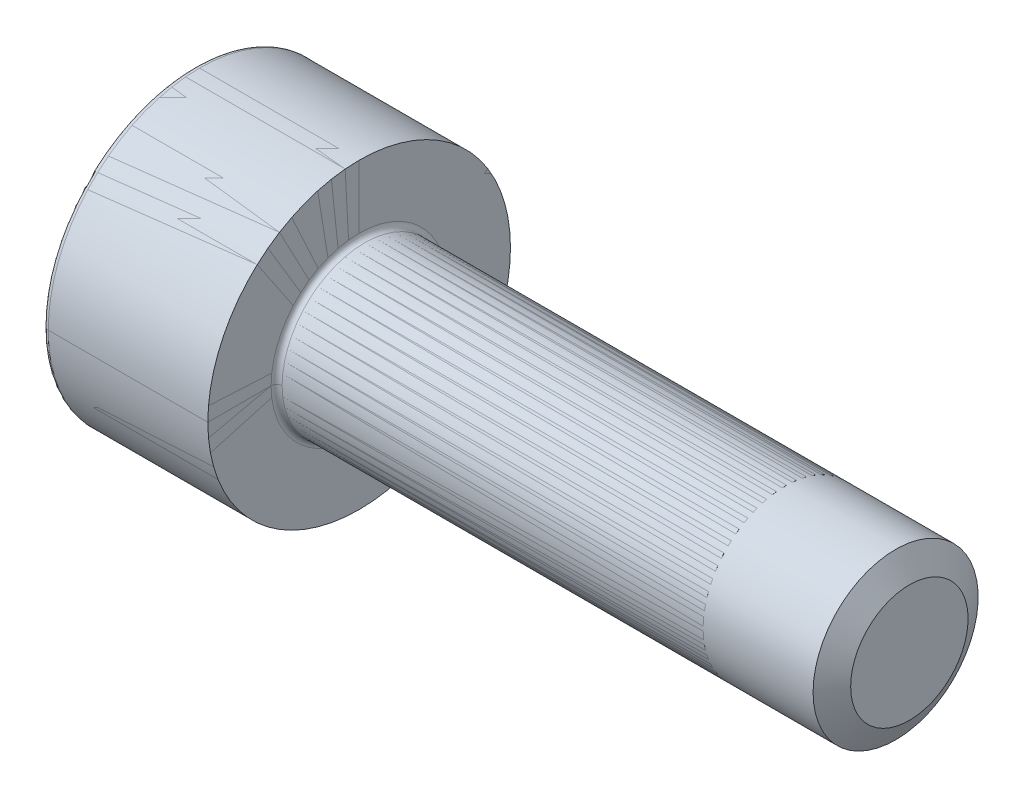
ISO-10303-21;
HEADER;
FILE_DESCRIPTION(('STEP AP214'),'2;1');
FILE_NAME('part.step','',(''),(''),'','','');
FILE_SCHEMA(('AUTOMOTIVE_DESIGN { 1 0 10303 214 1 1 1 1 }'));
ENDSEC;
DATA;
#1=APPLICATION_CONTEXT('core data for automotive mechanical design processes');
#2=APPLICATION_PROTOCOL_DEFINITION('international standard','automotive_design',2000,#1);
#3=PRODUCT_CONTEXT('',#1,'mechanical');
#4=PRODUCT('Part','Part','',(#3));
#5=PRODUCT_RELATED_PRODUCT_CATEGORY('part','',(#4));
#6=PRODUCT_DEFINITION_FORMATION('','',#4);
#7=PRODUCT_DEFINITION_CONTEXT('part definition',#1,'design');
#8=PRODUCT_DEFINITION('design','',#6,#7);
#9=PRODUCT_DEFINITION_SHAPE('','',#8);
#10=(LENGTH_UNIT() NAMED_UNIT(*) SI_UNIT(.MILLI.,.METRE.));
#11=(NAMED_UNIT(*) PLANE_ANGLE_UNIT() SI_UNIT($,.RADIAN.));
#12=(NAMED_UNIT(*) SI_UNIT($,.STERADIAN.) SOLID_ANGLE_UNIT());
#13=UNCERTAINTY_MEASURE_WITH_UNIT(LENGTH_MEASURE(1.E-05),#10,'distance_accuracy_value','');
#14=(GEOMETRIC_REPRESENTATION_CONTEXT(3) GLOBAL_UNCERTAINTY_ASSIGNED_CONTEXT((#13)) GLOBAL_UNIT_ASSIGNED_CONTEXT((#10,
#11,#12)) REPRESENTATION_CONTEXT('',''));
#15=CARTESIAN_POINT('',(0.,0.,0.));
#16=DIRECTION('',(0.,0.,1.));
#17=DIRECTION('',(1.,0.,0.));
#18=AXIS2_PLACEMENT_3D('',#15,#16,#17);
#19=CARTESIAN_POINT('',(0.1,0.,0.));
#20=DIRECTION('',(-1.,0.,0.));
#21=DIRECTION('',(0.,0.,1.));
#22=AXIS2_PLACEMENT_3D('',#19,#20,#21);
#23=TOROIDAL_SURFACE('',#22,2.65,0.1);
#24=CARTESIAN_POINT('',(0.1,0.,-2.65));
#25=DIRECTION('',(0.,1.,0.));
#26=DIRECTION('',(0.,0.,1.));
#27=AXIS2_PLACEMENT_3D('',#24,#25,#26);
#28=CIRCLE('',#27,0.1);
#29=CARTESIAN_POINT('',(0.1,0.,-2.75));
#30=VERTEX_POINT('',#29);
#31=CARTESIAN_POINT('',(0.,0.,-2.65));
#32=VERTEX_POINT('',#31);
#33=EDGE_CURVE('P0_E213',#30,#32,#28,.T.);
#34=ORIENTED_EDGE('',*,*,#33,.F.);
#35=CARTESIAN_POINT('',(0.1,0.,0.));
#36=DIRECTION('',(1.,0.,0.));
#37=DIRECTION('',(0.,0.,1.));
#38=AXIS2_PLACEMENT_3D('',#35,#36,#37);
#39=CIRCLE('',#38,2.75);
#40=CARTESIAN_POINT('',(0.1,0.,2.75));
#41=VERTEX_POINT('',#40);
#42=EDGE_CURVE('P0_E121',#41,#30,#39,.T.);
#43=ORIENTED_EDGE('',*,*,#42,.F.);
#44=CARTESIAN_POINT('',(0.1,0.,2.65));
#45=DIRECTION('',(0.,-1.,0.));
#46=DIRECTION('',(0.,0.,-1.));
#47=AXIS2_PLACEMENT_3D('',#44,#45,#46);
#48=CIRCLE('',#47,0.1);
#49=CARTESIAN_POINT('',(0.,0.,2.65));
#50=VERTEX_POINT('',#49);
#51=EDGE_CURVE('P0_E255',#41,#50,#48,.T.);
#52=ORIENTED_EDGE('',*,*,#51,.T.);
#53=CARTESIAN_POINT('',(0.,0.,0.));
#54=DIRECTION('',(-1.,0.,0.));
#55=DIRECTION('',(0.,0.,1.));
#56=AXIS2_PLACEMENT_3D('',#53,#54,#55);
#57=CIRCLE('',#56,2.65);
#58=EDGE_CURVE('P0_E167',#32,#50,#57,.T.);
#59=ORIENTED_EDGE('',*,*,#58,.F.);
#60=EDGE_LOOP('',(#34,#43,#52,#59));
#61=FACE_BOUND('',#60,.T.);
#62=ADVANCED_FACE('P0_F36',(#61),#23,.T.);
#63=CARTESIAN_POINT('',(1.3,-0.7175,1.24274645443067));
#64=DIRECTION('',(-1.,0.,0.));
#65=DIRECTION('',(0.,0.,1.));
#66=AXIS2_PLACEMENT_3D('',#63,#64,#65);
#67=PLANE('',#66);
#68=DIRECTION('',(0.,0.5,0.866025403784439));
#69=VECTOR('',#68,1.);
#70=CARTESIAN_POINT('',(1.3,-1.435,0.));
#71=LINE('',#70,#69);
#72=CARTESIAN_POINT('',(1.3,-1.435,0.));
#73=VERTEX_POINT('',#72);
#74=CARTESIAN_POINT('',(1.3,-0.7175,1.24274645443067));
#75=VERTEX_POINT('',#74);
#76=EDGE_CURVE('P0_E271',#73,#75,#71,.T.);
#77=ORIENTED_EDGE('',*,*,#76,.T.);
#78=DIRECTION('',(0.,1.,0.));
#79=VECTOR('',#78,1.);
#80=CARTESIAN_POINT('',(1.3,-0.7175,1.24274645443067));
#81=LINE('',#80,#79);
#82=CARTESIAN_POINT('',(1.3,0.7175,1.24274645443067));
#83=VERTEX_POINT('',#82);
#84=EDGE_CURVE('P0_E11',#75,#83,#81,.T.);
#85=ORIENTED_EDGE('',*,*,#84,.T.);
#86=DIRECTION('',(0.,0.5,-0.866025403784439));
#87=VECTOR('',#86,1.);
#88=CARTESIAN_POINT('',(1.3,0.7175,1.24274645443067));
#89=LINE('',#88,#87);
#90=CARTESIAN_POINT('',(1.3,1.435,0.));
#91=VERTEX_POINT('',#90);
#92=EDGE_CURVE('P0_E229',#83,#91,#89,.T.);
#93=ORIENTED_EDGE('',*,*,#92,.T.);
#94=DIRECTION('',(0.,-0.5,-0.866025403784439));
#95=VECTOR('',#94,1.);
#96=CARTESIAN_POINT('',(1.3,1.435,0.));
#97=LINE('',#96,#95);
#98=CARTESIAN_POINT('',(1.3,0.7175,-1.24274645443067));
#99=VERTEX_POINT('',#98);
#100=EDGE_CURVE('P0_E174',#91,#99,#97,.T.);
#101=ORIENTED_EDGE('',*,*,#100,.T.);
#102=DIRECTION('',(0.,-1.,0.));
#103=VECTOR('',#102,1.);
#104=CARTESIAN_POINT('',(1.3,0.7175,-1.24274645443067));
#105=LINE('',#104,#103);
#106=CARTESIAN_POINT('',(1.3,-0.7175,-1.24274645443067));
#107=VERTEX_POINT('',#106);
#108=EDGE_CURVE('P0_E232',#99,#107,#105,.T.);
#109=ORIENTED_EDGE('',*,*,#108,.T.);
#110=DIRECTION('',(0.,-0.5,0.866025403784439));
#111=VECTOR('',#110,1.);
#112=CARTESIAN_POINT('',(1.3,-0.7175,-1.24274645443067));
#113=LINE('',#112,#111);
#114=EDGE_CURVE('P0_E275',#107,#73,#113,.T.);
#115=ORIENTED_EDGE('',*,*,#114,.T.);
#116=EDGE_LOOP('',(#77,#85,#93,#101,#109,#115));
#117=FACE_BOUND('',#116,.T.);
#118=ADVANCED_FACE('P0_F320',(#117),#67,.T.);
#119=CARTESIAN_POINT('',(1.3,-0.7175,1.24274645443067));
#120=DIRECTION('',(0.,0.,1.));
#121=DIRECTION('',(0.,-1.,0.));
#122=AXIS2_PLACEMENT_3D('',#119,#120,#121);
#123=PLANE('',#122);
#124=DIRECTION('',(0.,1.,0.));
#125=VECTOR('',#124,1.);
#126=CARTESIAN_POINT('',(0.,-0.7175,1.24274645443067));
#127=LINE('',#126,#125);
#128=CARTESIAN_POINT('',(0.,-0.7175,1.24274645443067));
#129=VERTEX_POINT('',#128);
#130=CARTESIAN_POINT('',(0.,0.7175,1.24274645443067));
#131=VERTEX_POINT('',#130);
#132=EDGE_CURVE('P0_E192',#129,#131,#127,.T.);
#133=ORIENTED_EDGE('',*,*,#132,.T.);
#134=DIRECTION('',(-1.,0.,0.));
#135=VECTOR('',#134,1.);
#136=CARTESIAN_POINT('',(1.3,0.7175,1.24274645443067));
#137=LINE('',#136,#135);
#138=EDGE_CURVE('P0_E47',#83,#131,#137,.T.);
#139=ORIENTED_EDGE('',*,*,#138,.F.);
#140=ORIENTED_EDGE('',*,*,#84,.F.);
#141=DIRECTION('',(-1.,0.,0.));
#142=VECTOR('',#141,1.);
#143=CARTESIAN_POINT('',(1.3,-0.7175,1.24274645443067));
#144=LINE('',#143,#142);
#145=EDGE_CURVE('P0_E268',#75,#129,#144,.T.);
#146=ORIENTED_EDGE('',*,*,#145,.T.);
#147=EDGE_LOOP('',(#133,#139,#140,#146));
#148=FACE_BOUND('',#147,.T.);
#149=ADVANCED_FACE('P0_F325',(#148),#123,.F.);
#150=CARTESIAN_POINT('',(1.3,0.7175,1.24274645443067));
#151=DIRECTION('',(0.,0.866025403784439,0.5));
#152=DIRECTION('',(1.,0.,0.));
#153=AXIS2_PLACEMENT_3D('',#150,#151,#152);
#154=PLANE('',#153);
#155=DIRECTION('',(0.,0.5,-0.866025403784439));
#156=VECTOR('',#155,1.);
#157=CARTESIAN_POINT('',(0.,0.7175,1.24274645443067));
#158=LINE('',#157,#156);
#159=CARTESIAN_POINT('',(0.,1.435,0.));
#160=VERTEX_POINT('',#159);
#161=EDGE_CURVE('P0_E189',#131,#160,#158,.T.);
#162=ORIENTED_EDGE('',*,*,#161,.T.);
#163=DIRECTION('',(-1.,0.,0.));
#164=VECTOR('',#163,1.);
#165=CARTESIAN_POINT('',(1.3,1.435,0.));
#166=LINE('',#165,#164);
#167=EDGE_CURVE('P0_E225',#91,#160,#166,.T.);
#168=ORIENTED_EDGE('',*,*,#167,.F.);
#169=ORIENTED_EDGE('',*,*,#92,.F.);
#170=ORIENTED_EDGE('',*,*,#138,.T.);
#171=EDGE_LOOP('',(#162,#168,#169,#170));
#172=FACE_BOUND('',#171,.T.);
#173=ADVANCED_FACE('P0_F342',(#172),#154,.F.);
#174=CARTESIAN_POINT('',(1.3,1.435,0.));
#175=DIRECTION('',(0.,0.866025403784439,-0.5));
#176=DIRECTION('',(-1.,0.,0.));
#177=AXIS2_PLACEMENT_3D('',#174,#175,#176);
#178=PLANE('',#177);
#179=DIRECTION('',(0.,-0.5,-0.866025403784439));
#180=VECTOR('',#179,1.);
#181=CARTESIAN_POINT('',(0.,1.435,0.));
#182=LINE('',#181,#180);
#183=CARTESIAN_POINT('',(0.,0.7175,-1.24274645443067));
#184=VERTEX_POINT('',#183);
#185=EDGE_CURVE('P0_E187',#160,#184,#182,.T.);
#186=ORIENTED_EDGE('',*,*,#185,.T.);
#187=DIRECTION('',(-1.,0.,0.));
#188=VECTOR('',#187,1.);
#189=CARTESIAN_POINT('',(1.3,0.7175,-1.24274645443067));
#190=LINE('',#189,#188);
#191=EDGE_CURVE('P0_E226',#99,#184,#190,.T.);
#192=ORIENTED_EDGE('',*,*,#191,.F.);
#193=ORIENTED_EDGE('',*,*,#100,.F.);
#194=ORIENTED_EDGE('',*,*,#167,.T.);
#195=EDGE_LOOP('',(#186,#192,#193,#194));
#196=FACE_BOUND('',#195,.T.);
#197=ADVANCED_FACE('P0_F335',(#196),#178,.F.);
#198=CARTESIAN_POINT('',(1.3,0.7175,-1.24274645443067));
#199=DIRECTION('',(0.,0.,-1.));
#200=DIRECTION('',(0.,-1.,0.));
#201=AXIS2_PLACEMENT_3D('',#198,#199,#200);
#202=PLANE('',#201);
#203=DIRECTION('',(0.,-1.,0.));
#204=VECTOR('',#203,1.);
#205=CARTESIAN_POINT('',(0.,0.7175,-1.24274645443067));
#206=LINE('',#205,#204);
#207=CARTESIAN_POINT('',(0.,-0.7175,-1.24274645443067));
#208=VERTEX_POINT('',#207);
#209=EDGE_CURVE('P0_E184',#184,#208,#206,.T.);
#210=ORIENTED_EDGE('',*,*,#209,.T.);
#211=DIRECTION('',(-1.,0.,0.));
#212=VECTOR('',#211,1.);
#213=CARTESIAN_POINT('',(1.3,-0.7175,-1.24274645443067));
#214=LINE('',#213,#212);
#215=EDGE_CURVE('P0_E40',#107,#208,#214,.T.);
#216=ORIENTED_EDGE('',*,*,#215,.F.);
#217=ORIENTED_EDGE('',*,*,#108,.F.);
#218=ORIENTED_EDGE('',*,*,#191,.T.);
#219=EDGE_LOOP('',(#210,#216,#217,#218));
#220=FACE_BOUND('',#219,.T.);
#221=ADVANCED_FACE('P0_F331',(#220),#202,.F.);
#222=CARTESIAN_POINT('',(1.3,-0.7175,-1.24274645443067));
#223=DIRECTION('',(0.,-0.866025403784439,-0.5));
#224=DIRECTION('',(0.,0.5,-0.866025403784439));
#225=AXIS2_PLACEMENT_3D('',#222,#223,#224);
#226=PLANE('',#225);
#227=DIRECTION('',(0.,-0.5,0.866025403784439));
#228=VECTOR('',#227,1.);
#229=CARTESIAN_POINT('',(0.,-0.7175,-1.24274645443067));
#230=LINE('',#229,#228);
#231=CARTESIAN_POINT('',(0.,-1.435,0.));
#232=VERTEX_POINT('',#231);
#233=EDGE_CURVE('P0_E188',#208,#232,#230,.T.);
#234=ORIENTED_EDGE('',*,*,#233,.T.);
#235=DIRECTION('',(-1.,0.,0.));
#236=VECTOR('',#235,1.);
#237=CARTESIAN_POINT('',(1.3,-1.435,0.));
#238=LINE('',#237,#236);
#239=EDGE_CURVE('P0_E273',#73,#232,#238,.T.);
#240=ORIENTED_EDGE('',*,*,#239,.F.);
#241=ORIENTED_EDGE('',*,*,#114,.F.);
#242=ORIENTED_EDGE('',*,*,#215,.T.);
#243=EDGE_LOOP('',(#234,#240,#241,#242));
#244=FACE_BOUND('',#243,.T.);
#245=ADVANCED_FACE('P0_F334',(#244),#226,.F.);
#246=CARTESIAN_POINT('',(1.3,-1.435,0.));
#247=DIRECTION('',(0.,-0.866025403784439,0.5));
#248=DIRECTION('',(-1.,0.,0.));
#249=AXIS2_PLACEMENT_3D('',#246,#247,#248);
#250=PLANE('',#249);
#251=DIRECTION('',(0.,0.5,0.866025403784439));
#252=VECTOR('',#251,1.);
#253=CARTESIAN_POINT('',(0.,-1.435,0.));
#254=LINE('',#253,#252);
#255=EDGE_CURVE('P0_E177',#232,#129,#254,.T.);
#256=ORIENTED_EDGE('',*,*,#255,.T.);
#257=ORIENTED_EDGE('',*,*,#145,.F.);
#258=ORIENTED_EDGE('',*,*,#76,.F.);
#259=ORIENTED_EDGE('',*,*,#239,.T.);
#260=EDGE_LOOP('',(#256,#257,#258,#259));
#261=FACE_BOUND('',#260,.T.);
#262=ADVANCED_FACE('P0_F356',(#261),#250,.F.);
#263=CARTESIAN_POINT('',(3.1,0.,0.));
#264=DIRECTION('',(1.,0.,0.));
#265=DIRECTION('',(0.,0.,-1.));
#266=AXIS2_PLACEMENT_3D('',#263,#264,#265);
#267=TOROIDAL_SURFACE('',#266,1.6,0.1);
#268=CARTESIAN_POINT('',(3.1,0.,1.6));
#269=DIRECTION('',(0.,1.,0.));
#270=DIRECTION('',(0.,0.,1.));
#271=AXIS2_PLACEMENT_3D('',#268,#269,#270);
#272=CIRCLE('',#271,0.1);
#273=CARTESIAN_POINT('',(3.1,0.,1.5));
#274=VERTEX_POINT('',#273);
#275=CARTESIAN_POINT('',(3.,0.,1.6));
#276=VERTEX_POINT('',#275);
#277=EDGE_CURVE('P0_E286',#274,#276,#272,.T.);
#278=ORIENTED_EDGE('',*,*,#277,.F.);
#279=CARTESIAN_POINT('',(3.1,0.,0.));
#280=DIRECTION('',(1.,0.,0.));
#281=DIRECTION('',(0.,0.,-1.));
#282=AXIS2_PLACEMENT_3D('',#279,#280,#281);
#283=CIRCLE('',#282,1.5);
#284=CARTESIAN_POINT('',(3.1,0.,-1.5));
#285=VERTEX_POINT('',#284);
#286=EDGE_CURVE('P0_E158',#285,#274,#283,.T.);
#287=ORIENTED_EDGE('',*,*,#286,.F.);
#288=CARTESIAN_POINT('',(3.1,0.,-1.6));
#289=DIRECTION('',(0.,-1.,0.));
#290=DIRECTION('',(0.,0.,-1.));
#291=AXIS2_PLACEMENT_3D('',#288,#289,#290);
#292=CIRCLE('',#291,0.1);
#293=CARTESIAN_POINT('',(3.,0.,-1.6));
#294=VERTEX_POINT('',#293);
#295=EDGE_CURVE('P0_E183',#285,#294,#292,.T.);
#296=ORIENTED_EDGE('',*,*,#295,.T.);
#297=CARTESIAN_POINT('',(3.,0.,0.));
#298=DIRECTION('',(1.,0.,0.));
#299=DIRECTION('',(0.,0.,-1.));
#300=AXIS2_PLACEMENT_3D('',#297,#298,#299);
#301=CIRCLE('',#300,1.6);
#302=EDGE_CURVE('P0_E217',#294,#276,#301,.T.);
#303=ORIENTED_EDGE('',*,*,#302,.T.);
#304=EDGE_LOOP('',(#278,#287,#296,#303));
#305=FACE_BOUND('',#304,.T.);
#306=ADVANCED_FACE('P0_F339',(#305),#267,.F.);
#307=CARTESIAN_POINT('',(3.,2.75,0.));
#308=DIRECTION('',(1.,0.,0.));
#309=DIRECTION('',(0.,1.,0.));
#310=AXIS2_PLACEMENT_3D('',#307,#308,#309);
#311=PLANE('',#310);
#312=ORIENTED_EDGE('',*,*,#302,.F.);
#313=CARTESIAN_POINT('',(3.,0.,0.));
#314=DIRECTION('',(1.,0.,0.));
#315=DIRECTION('',(0.,0.,-1.));
#316=AXIS2_PLACEMENT_3D('',#313,#314,#315);
#317=CIRCLE('',#316,1.6);
#318=EDGE_CURVE('P0_E244',#276,#294,#317,.T.);
#319=ORIENTED_EDGE('',*,*,#318,.F.);
#320=EDGE_LOOP('',(#312,#319));
#321=FACE_BOUND('',#320,.T.);
#322=CARTESIAN_POINT('',(3.,0.,0.));
#323=DIRECTION('',(1.,0.,0.));
#324=DIRECTION('',(0.,0.,-1.));
#325=AXIS2_PLACEMENT_3D('',#322,#323,#324);
#326=CIRCLE('',#325,2.75);
#327=CARTESIAN_POINT('',(3.,0.,-2.75));
#328=VERTEX_POINT('',#327);
#329=CARTESIAN_POINT('',(3.,0.,2.75));
#330=VERTEX_POINT('',#329);
#331=EDGE_CURVE('P0_E182',#328,#330,#326,.T.);
#332=ORIENTED_EDGE('',*,*,#331,.T.);
#333=CARTESIAN_POINT('',(3.,0.,0.));
#334=DIRECTION('',(1.,0.,0.));
#335=DIRECTION('',(0.,0.,-1.));
#336=AXIS2_PLACEMENT_3D('',#333,#334,#335);
#337=CIRCLE('',#336,2.75);
#338=EDGE_CURVE('P0_E215',#330,#328,#337,.T.);
#339=ORIENTED_EDGE('',*,*,#338,.T.);
#340=EDGE_LOOP('',(#332,#339));
#341=FACE_BOUND('',#340,.T.);
#342=ADVANCED_FACE('P0_F336',(#321,#341),#311,.T.);
#343=CARTESIAN_POINT('',(0.,0.,0.));
#344=DIRECTION('',(1.,0.,0.));
#345=DIRECTION('',(0.,0.,-1.));
#346=AXIS2_PLACEMENT_3D('',#343,#344,#345);
#347=CYLINDRICAL_SURFACE('',#346,2.75);
#348=DIRECTION('',(1.,0.,0.));
#349=VECTOR('',#348,1.);
#350=CARTESIAN_POINT('',(0.,0.,2.75));
#351=LINE('',#350,#349);
#352=EDGE_CURVE('P0_E178',#41,#330,#351,.T.);
#353=ORIENTED_EDGE('',*,*,#352,.F.);
#354=ORIENTED_EDGE('',*,*,#42,.T.);
#355=DIRECTION('',(1.,0.,0.));
#356=VECTOR('',#355,1.);
#357=CARTESIAN_POINT('',(0.,0.,-2.75));
#358=LINE('',#357,#356);
#359=EDGE_CURVE('P0_E170',#30,#328,#358,.T.);
#360=ORIENTED_EDGE('',*,*,#359,.T.);
#361=ORIENTED_EDGE('',*,*,#338,.F.);
#362=EDGE_LOOP('',(#353,#354,#360,#361));
#363=FACE_BOUND('',#362,.T.);
#364=ADVANCED_FACE('P0_F338',(#363),#347,.T.);
#365=CARTESIAN_POINT('',(0.,0.,0.));
#366=DIRECTION('',(-1.,0.,0.));
#367=DIRECTION('',(0.,0.,1.));
#368=AXIS2_PLACEMENT_3D('',#365,#366,#367);
#369=PLANE('',#368);
#370=ORIENTED_EDGE('',*,*,#255,.F.);
#371=ORIENTED_EDGE('',*,*,#233,.F.);
#372=ORIENTED_EDGE('',*,*,#209,.F.);
#373=ORIENTED_EDGE('',*,*,#185,.F.);
#374=ORIENTED_EDGE('',*,*,#161,.F.);
#375=ORIENTED_EDGE('',*,*,#132,.F.);
#376=EDGE_LOOP('',(#370,#371,#372,#373,#374,#375));
#377=FACE_BOUND('',#376,.T.);
#378=CARTESIAN_POINT('',(0.,0.,0.));
#379=DIRECTION('',(-1.,0.,0.));
#380=DIRECTION('',(0.,0.,1.));
#381=AXIS2_PLACEMENT_3D('',#378,#379,#380);
#382=CIRCLE('',#381,2.65);
#383=EDGE_CURVE('P0_E252',#50,#32,#382,.T.);
#384=ORIENTED_EDGE('',*,*,#383,.T.);
#385=ORIENTED_EDGE('',*,*,#58,.T.);
#386=EDGE_LOOP('',(#384,#385));
#387=FACE_BOUND('',#386,.T.);
#388=ADVANCED_FACE('P0_F329',(#377,#387),#369,.T.);
#389=CARTESIAN_POINT('',(0.,0.,0.));
#390=DIRECTION('',(1.,0.,0.));
#391=DIRECTION('',(0.,0.,-1.));
#392=AXIS2_PLACEMENT_3D('',#389,#390,#391);
#393=CYLINDRICAL_SURFACE('',#392,1.5);
#394=ORIENTED_EDGE('',*,*,#286,.T.);
#395=DIRECTION('',(1.,0.,0.));
#396=VECTOR('',#395,1.);
#397=CARTESIAN_POINT('',(0.,0.,1.5));
#398=LINE('',#397,#396);
#399=CARTESIAN_POINT('',(10.75,0.,1.5));
#400=VERTEX_POINT('',#399);
#401=EDGE_CURVE('P0_E153',#274,#400,#398,.T.);
#402=ORIENTED_EDGE('',*,*,#401,.T.);
#403=ORIENTED_EDGE('',*,*,#401,.F.);
#404=CARTESIAN_POINT('',(3.1,0.,0.));
#405=DIRECTION('',(1.,0.,0.));
#406=DIRECTION('',(0.,0.,-1.));
#407=AXIS2_PLACEMENT_3D('',#404,#405,#406);
#408=CIRCLE('',#407,1.5);
#409=EDGE_CURVE('P0_E264',#274,#285,#408,.T.);
#410=ORIENTED_EDGE('',*,*,#409,.T.);
#411=DIRECTION('',(1.,0.,0.));
#412=VECTOR('',#411,1.);
#413=CARTESIAN_POINT('',(0.,0.,-1.5));
#414=LINE('',#413,#412);
#415=CARTESIAN_POINT('',(10.75,0.,-1.5));
#416=VERTEX_POINT('',#415);
#417=EDGE_CURVE('P0_E161',#285,#416,#414,.T.);
#418=ORIENTED_EDGE('',*,*,#417,.T.);
#419=ORIENTED_EDGE('',*,*,#417,.F.);
#420=EDGE_LOOP('',(#394,#402,#403,#410,#418,#419));
#421=FACE_BOUND('',#420,.T.);
#422=CARTESIAN_POINT('',(12.75,0.,0.));
#423=DIRECTION('',(-1.,0.,0.));
#424=DIRECTION('',(0.,0.,1.));
#425=AXIS2_PLACEMENT_3D('',#422,#423,#424);
#426=CIRCLE('',#425,1.5);
#427=CARTESIAN_POINT('',(12.75,0.,1.5));
#428=VERTEX_POINT('',#427);
#429=EDGE_CURVE('P0_E300',#428,#428,#426,.T.);
#430=ORIENTED_EDGE('',*,*,#429,.T.);
#431=EDGE_LOOP('',(#430));
#432=FACE_BOUND('',#431,.T.);
#433=ADVANCED_FACE('P0_F154',(#421,#432),#393,.T.);
#434=CARTESIAN_POINT('',(0.,0.,0.));
#435=DIRECTION('',(1.,0.,0.));
#436=DIRECTION('',(0.,0.,-1.));
#437=AXIS2_PLACEMENT_3D('',#434,#435,#436);
#438=CYLINDRICAL_SURFACE('',#437,2.75);
#439=CARTESIAN_POINT('',(0.1,0.,0.));
#440=DIRECTION('',(1.,0.,0.));
#441=DIRECTION('',(0.,0.,1.));
#442=AXIS2_PLACEMENT_3D('',#439,#440,#441);
#443=CIRCLE('',#442,2.75);
#444=EDGE_CURVE('P0_E257',#30,#41,#443,.T.);
#445=ORIENTED_EDGE('',*,*,#444,.T.);
#446=ORIENTED_EDGE('',*,*,#352,.T.);
#447=ORIENTED_EDGE('',*,*,#331,.F.);
#448=ORIENTED_EDGE('',*,*,#359,.F.);
#449=EDGE_LOOP('',(#445,#446,#447,#448));
#450=FACE_BOUND('',#449,.T.);
#451=ADVANCED_FACE('P0_F347',(#450),#438,.T.);
#452=CARTESIAN_POINT('',(3.1,0.,0.));
#453=DIRECTION('',(1.,0.,0.));
#454=DIRECTION('',(0.,0.,-1.));
#455=AXIS2_PLACEMENT_3D('',#452,#453,#454);
#456=TOROIDAL_SURFACE('',#455,1.6,0.1);
#457=ORIENTED_EDGE('',*,*,#409,.F.);
#458=ORIENTED_EDGE('',*,*,#277,.T.);
#459=ORIENTED_EDGE('',*,*,#318,.T.);
#460=ORIENTED_EDGE('',*,*,#295,.F.);
#461=EDGE_LOOP('',(#457,#458,#459,#460));
#462=FACE_BOUND('',#461,.T.);
#463=ADVANCED_FACE('P0_F316',(#462),#456,.F.);
#464=CARTESIAN_POINT('',(0.1,0.,0.));
#465=DIRECTION('',(-1.,0.,0.));
#466=DIRECTION('',(0.,0.,1.));
#467=AXIS2_PLACEMENT_3D('',#464,#465,#466);
#468=TOROIDAL_SURFACE('',#467,2.65,0.1);
#469=ORIENTED_EDGE('',*,*,#444,.F.);
#470=ORIENTED_EDGE('',*,*,#33,.T.);
#471=ORIENTED_EDGE('',*,*,#383,.F.);
#472=ORIENTED_EDGE('',*,*,#51,.F.);
#473=EDGE_LOOP('',(#469,#470,#471,#472));
#474=FACE_BOUND('',#473,.T.);
#475=ADVANCED_FACE('P0_F38',(#474),#468,.T.);
#476=CARTESIAN_POINT('',(13.,0.,0.));
#477=DIRECTION('',(-1.,0.,0.));
#478=DIRECTION('',(0.,0.,1.));
#479=AXIS2_PLACEMENT_3D('',#476,#477,#478);
#480=PLANE('',#479);
#481=CARTESIAN_POINT('',(13.,0.,0.));
#482=DIRECTION('',(-1.,0.,0.));
#483=DIRECTION('',(0.,0.,1.));
#484=AXIS2_PLACEMENT_3D('',#481,#482,#483);
#485=CIRCLE('',#484,1.067);
#486=CARTESIAN_POINT('',(13.,0.,1.067));
#487=VERTEX_POINT('',#486);
#488=EDGE_CURVE('P0_E261',#487,#487,#485,.T.);
#489=ORIENTED_EDGE('',*,*,#488,.F.);
#490=EDGE_LOOP('',(#489));
#491=FACE_BOUND('',#490,.T.);
#492=ADVANCED_FACE('P0_F307',(#491),#480,.F.);
#493=CARTESIAN_POINT('',(13.,0.,0.));
#494=DIRECTION('',(-1.,0.,0.));
#495=DIRECTION('',(0.,0.,1.));
#496=AXIS2_PLACEMENT_3D('',#493,#494,#495);
#497=CONICAL_SURFACE('',#496,1.067,1.04718484902493);
#498=ORIENTED_EDGE('',*,*,#429,.F.);
#499=EDGE_LOOP('',(#498));
#500=FACE_BOUND('',#499,.T.);
#501=ORIENTED_EDGE('',*,*,#488,.T.);
#502=EDGE_LOOP('',(#501));
#503=FACE_BOUND('',#502,.T.);
#504=ADVANCED_FACE('P0_F304',(#500,#503),#497,.T.);
#505=CLOSED_SHELL('',(#62,#118,#149,#173,#197,#221,#245,#262,#306,#342,#364,#388,#433,#451,#463,
#475,#492,#504));
#506=MANIFOLD_SOLID_BREP('P0_B2',#505);
#507=CARTESIAN_POINT('',(11.,1.5,0.));
#508=DIRECTION('',(1.,0.,0.));
#509=DIRECTION('',(0.,1.,0.));
#510=AXIS2_PLACEMENT_3D('',#507,#508,#509);
#511=PLANE('',#510);
#512=CARTESIAN_POINT('',(11.,0.,0.));
#513=DIRECTION('',(-1.,0.,0.));
#514=DIRECTION('',(0.,0.,1.));
#515=AXIS2_PLACEMENT_3D('',#512,#513,#514);
#516=CIRCLE('',#515,1.067);
#517=CARTESIAN_POINT('',(11.,0.,1.067));
#518=VERTEX_POINT('',#517);
#519=CARTESIAN_POINT('',(11.,0.,-1.067));
#520=VERTEX_POINT('',#519);
#521=EDGE_CURVE('P1_E202',#518,#520,#516,.T.);
#522=ORIENTED_EDGE('',*,*,#521,.F.);
#523=CARTESIAN_POINT('',(11.,0.,0.));
#524=DIRECTION('',(-1.,0.,0.));
#525=DIRECTION('',(0.,0.,1.));
#526=AXIS2_PLACEMENT_3D('',#523,#524,#525);
#527=CIRCLE('',#526,1.067);
#528=EDGE_CURVE('P1_E11',#520,#518,#527,.T.);
#529=ORIENTED_EDGE('',*,*,#528,.F.);
#530=EDGE_LOOP('',(#522,#529));
#531=FACE_BOUND('',#530,.T.);
#532=ADVANCED_FACE('P1_F16',(#531),#511,.T.);
#533=CARTESIAN_POINT('',(10.75,0.,0.));
#534=DIRECTION('',(-1.,0.,0.));
#535=DIRECTION('',(0.,0.,1.));
#536=AXIS2_PLACEMENT_3D('',#533,#534,#535);
#537=CONICAL_SURFACE('',#536,1.5,1.04718484902493);
#538=DIRECTION('',(-0.500011000363013,0.,-0.866019052628739));
#539=VECTOR('',#538,1.);
#540=CARTESIAN_POINT('',(10.75,0.,-1.5));
#541=LINE('',#540,#539);
#542=CARTESIAN_POINT('',(10.75,0.,-1.5));
#543=VERTEX_POINT('',#542);
#544=EDGE_CURVE('P1_E245',#520,#543,#541,.T.);
#545=ORIENTED_EDGE('',*,*,#544,.F.);
#546=ORIENTED_EDGE('',*,*,#528,.T.);
#547=DIRECTION('',(-0.500011000363013,0.,0.866019052628739));
#548=VECTOR('',#547,1.);
#549=CARTESIAN_POINT('',(10.75,0.,1.5));
#550=LINE('',#549,#548);
#551=CARTESIAN_POINT('',(10.75,0.,1.5));
#552=VERTEX_POINT('',#551);
#553=EDGE_CURVE('P1_E257',#518,#552,#550,.T.);
#554=ORIENTED_EDGE('',*,*,#553,.T.);
#555=CARTESIAN_POINT('',(10.75,0.,0.));
#556=DIRECTION('',(-1.,0.,0.));
#557=DIRECTION('',(0.,0.,1.));
#558=AXIS2_PLACEMENT_3D('',#555,#556,#557);
#559=CIRCLE('',#558,1.5);
#560=EDGE_CURVE('P1_E124',#543,#552,#559,.T.);
#561=ORIENTED_EDGE('',*,*,#560,.F.);
#562=EDGE_LOOP('',(#545,#546,#554,#561));
#563=FACE_BOUND('',#562,.T.);
#564=ADVANCED_FACE('P1_F267',(#563),#537,.T.);
#565=CARTESIAN_POINT('',(0.1,0.,0.));
#566=DIRECTION('',(-1.,0.,0.));
#567=DIRECTION('',(0.,0.,1.));
#568=AXIS2_PLACEMENT_3D('',#565,#566,#567);
#569=TOROIDAL_SURFACE('',#568,2.65,0.1);
#570=CARTESIAN_POINT('',(0.1,0.,-2.65));
#571=DIRECTION('',(0.,1.,0.));
#572=DIRECTION('',(0.,0.,1.));
#573=AXIS2_PLACEMENT_3D('',#570,#571,#572);
#574=CIRCLE('',#573,0.1);
#575=CARTESIAN_POINT('',(0.1,0.,-2.75));
#576=VERTEX_POINT('',#575);
#577=CARTESIAN_POINT('',(0.,0.,-2.65));
#578=VERTEX_POINT('',#577);
#579=EDGE_CURVE('P1_E334',#576,#578,#574,.T.);
#580=ORIENTED_EDGE('',*,*,#579,.F.);
#581=CARTESIAN_POINT('',(0.1,0.,0.));
#582=DIRECTION('',(1.,0.,0.));
#583=DIRECTION('',(0.,0.,1.));
#584=AXIS2_PLACEMENT_3D('',#581,#582,#583);
#585=CIRCLE('',#584,2.75);
#586=CARTESIAN_POINT('',(0.1,0.,2.75));
#587=VERTEX_POINT('',#586);
#588=EDGE_CURVE('P1_E112',#587,#576,#585,.T.);
#589=ORIENTED_EDGE('',*,*,#588,.F.);
#590=CARTESIAN_POINT('',(0.1,0.,2.65));
#591=DIRECTION('',(0.,-1.,0.));
#592=DIRECTION('',(0.,0.,-1.));
#593=AXIS2_PLACEMENT_3D('',#590,#591,#592);
#594=CIRCLE('',#593,0.1);
#595=CARTESIAN_POINT('',(0.,0.,2.65));
#596=VERTEX_POINT('',#595);
#597=EDGE_CURVE('P1_E292',#587,#596,#594,.T.);
#598=ORIENTED_EDGE('',*,*,#597,.T.);
#599=CARTESIAN_POINT('',(0.,0.,0.));
#600=DIRECTION('',(-1.,0.,0.));
#601=DIRECTION('',(0.,0.,1.));
#602=AXIS2_PLACEMENT_3D('',#599,#600,#601);
#603=CIRCLE('',#602,2.65);
#604=EDGE_CURVE('P1_E189',#578,#596,#603,.T.);
#605=ORIENTED_EDGE('',*,*,#604,.F.);
#606=EDGE_LOOP('',(#580,#589,#598,#605));
#607=FACE_BOUND('',#606,.T.);
#608=ADVANCED_FACE('P1_F355',(#607),#569,.T.);
#609=CARTESIAN_POINT('',(1.3,-0.7175,1.24274645443067));
#610=DIRECTION('',(-1.,0.,0.));
#611=DIRECTION('',(0.,0.,1.));
#612=AXIS2_PLACEMENT_3D('',#609,#610,#611);
#613=PLANE('',#612);
#614=DIRECTION('',(0.,0.5,0.866025403784439));
#615=VECTOR('',#614,1.);
#616=CARTESIAN_POINT('',(1.3,-1.435,0.));
#617=LINE('',#616,#615);
#618=CARTESIAN_POINT('',(1.3,-1.435,0.));
#619=VERTEX_POINT('',#618);
#620=CARTESIAN_POINT('',(1.3,-0.7175,1.24274645443067));
#621=VERTEX_POINT('',#620);
#622=EDGE_CURVE('P1_E173',#619,#621,#617,.T.);
#623=ORIENTED_EDGE('',*,*,#622,.T.);
#624=DIRECTION('',(0.,1.,0.));
#625=VECTOR('',#624,1.);
#626=CARTESIAN_POINT('',(1.3,-0.7175,1.24274645443067));
#627=LINE('',#626,#625);
#628=CARTESIAN_POINT('',(1.3,0.7175,1.24274645443067));
#629=VERTEX_POINT('',#628);
#630=EDGE_CURVE('P1_E27',#621,#629,#627,.T.);
#631=ORIENTED_EDGE('',*,*,#630,.T.);
#632=DIRECTION('',(0.,0.5,-0.866025403784439));
#633=VECTOR('',#632,1.);
#634=CARTESIAN_POINT('',(1.3,0.7175,1.24274645443067));
#635=LINE('',#634,#633);
#636=CARTESIAN_POINT('',(1.3,1.435,0.));
#637=VERTEX_POINT('',#636);
#638=EDGE_CURVE('P1_E307',#629,#637,#635,.T.);
#639=ORIENTED_EDGE('',*,*,#638,.T.);
#640=DIRECTION('',(0.,-0.5,-0.866025403784439));
#641=VECTOR('',#640,1.);
#642=CARTESIAN_POINT('',(1.3,1.435,0.));
#643=LINE('',#642,#641);
#644=CARTESIAN_POINT('',(1.3,0.7175,-1.24274645443067));
#645=VERTEX_POINT('',#644);
#646=EDGE_CURVE('P1_E206',#637,#645,#643,.T.);
#647=ORIENTED_EDGE('',*,*,#646,.T.);
#648=DIRECTION('',(0.,-1.,0.));
#649=VECTOR('',#648,1.);
#650=CARTESIAN_POINT('',(1.3,0.7175,-1.24274645443067));
#651=LINE('',#650,#649);
#652=CARTESIAN_POINT('',(1.3,-0.7175,-1.24274645443067));
#653=VERTEX_POINT('',#652);
#654=EDGE_CURVE('P1_E321',#645,#653,#651,.T.);
#655=ORIENTED_EDGE('',*,*,#654,.T.);
#656=DIRECTION('',(0.,-0.5,0.866025403784439));
#657=VECTOR('',#656,1.);
#658=CARTESIAN_POINT('',(1.3,-0.7175,-1.24274645443067));
#659=LINE('',#658,#657);
#660=EDGE_CURVE('P1_E312',#653,#619,#659,.T.);
#661=ORIENTED_EDGE('',*,*,#660,.T.);
#662=EDGE_LOOP('',(#623,#631,#639,#647,#655,#661));
#663=FACE_BOUND('',#662,.T.);
#664=ADVANCED_FACE('P1_F378',(#663),#613,.T.);
#665=CARTESIAN_POINT('',(1.3,-0.7175,1.24274645443067));
#666=DIRECTION('',(0.,0.,1.));
#667=DIRECTION('',(0.,-1.,0.));
#668=AXIS2_PLACEMENT_3D('',#665,#666,#667);
#669=PLANE('',#668);
#670=DIRECTION('',(0.,1.,0.));
#671=VECTOR('',#670,1.);
#672=CARTESIAN_POINT('',(0.,-0.7175,1.24274645443067));
#673=LINE('',#672,#671);
#674=CARTESIAN_POINT('',(0.,-0.7175,1.24274645443067));
#675=VERTEX_POINT('',#674);
#676=CARTESIAN_POINT('',(0.,0.7175,1.24274645443067));
#677=VERTEX_POINT('',#676);
#678=EDGE_CURVE('P1_E170',#675,#677,#673,.T.);
#679=ORIENTED_EDGE('',*,*,#678,.T.);
#680=DIRECTION('',(-1.,0.,0.));
#681=VECTOR('',#680,1.);
#682=CARTESIAN_POINT('',(1.3,0.7175,1.24274645443067));
#683=LINE('',#682,#681);
#684=EDGE_CURVE('P1_E304',#629,#677,#683,.T.);
#685=ORIENTED_EDGE('',*,*,#684,.F.);
#686=ORIENTED_EDGE('',*,*,#630,.F.);
#687=DIRECTION('',(-1.,0.,0.));
#688=VECTOR('',#687,1.);
#689=CARTESIAN_POINT('',(1.3,-0.7175,1.24274645443067));
#690=LINE('',#689,#688);
#691=EDGE_CURVE('P1_E167',#621,#675,#690,.T.);
#692=ORIENTED_EDGE('',*,*,#691,.T.);
#693=EDGE_LOOP('',(#679,#685,#686,#692));
#694=FACE_BOUND('',#693,.T.);
#695=ADVANCED_FACE('P1_F169',(#694),#669,.F.);
#696=CARTESIAN_POINT('',(1.3,0.7175,1.24274645443067));
#697=DIRECTION('',(0.,0.866025403784439,0.5));
#698=DIRECTION('',(1.,0.,0.));
#699=AXIS2_PLACEMENT_3D('',#696,#697,#698);
#700=PLANE('',#699);
#701=DIRECTION('',(0.,0.5,-0.866025403784439));
#702=VECTOR('',#701,1.);
#703=CARTESIAN_POINT('',(0.,0.7175,1.24274645443067));
#704=LINE('',#703,#702);
#705=CARTESIAN_POINT('',(0.,1.435,0.));
#706=VERTEX_POINT('',#705);
#707=EDGE_CURVE('P1_E183',#677,#706,#704,.T.);
#708=ORIENTED_EDGE('',*,*,#707,.T.);
#709=DIRECTION('',(-1.,0.,0.));
#710=VECTOR('',#709,1.);
#711=CARTESIAN_POINT('',(1.3,1.435,0.));
#712=LINE('',#711,#710);
#713=EDGE_CURVE('P1_E210',#637,#706,#712,.T.);
#714=ORIENTED_EDGE('',*,*,#713,.F.);
#715=ORIENTED_EDGE('',*,*,#638,.F.);
#716=ORIENTED_EDGE('',*,*,#684,.T.);
#717=EDGE_LOOP('',(#708,#714,#715,#716));
#718=FACE_BOUND('',#717,.T.);
#719=ADVANCED_FACE('P1_F377',(#718),#700,.F.);
#720=CARTESIAN_POINT('',(1.3,1.435,0.));
#721=DIRECTION('',(0.,0.866025403784439,-0.5));
#722=DIRECTION('',(-1.,0.,0.));
#723=AXIS2_PLACEMENT_3D('',#720,#721,#722);
#724=PLANE('',#723);
#725=DIRECTION('',(0.,-0.5,-0.866025403784439));
#726=VECTOR('',#725,1.);
#727=CARTESIAN_POINT('',(0.,1.435,0.));
#728=LINE('',#727,#726);
#729=CARTESIAN_POINT('',(0.,0.7175,-1.24274645443067));
#730=VERTEX_POINT('',#729);
#731=EDGE_CURVE('P1_E225',#706,#730,#728,.T.);
#732=ORIENTED_EDGE('',*,*,#731,.T.);
#733=DIRECTION('',(-1.,0.,0.));
#734=VECTOR('',#733,1.);
#735=CARTESIAN_POINT('',(1.3,0.7175,-1.24274645443067));
#736=LINE('',#735,#734);
#737=EDGE_CURVE('P1_E211',#645,#730,#736,.T.);
#738=ORIENTED_EDGE('',*,*,#737,.F.);
#739=ORIENTED_EDGE('',*,*,#646,.F.);
#740=ORIENTED_EDGE('',*,*,#713,.T.);
#741=EDGE_LOOP('',(#732,#738,#739,#740));
#742=FACE_BOUND('',#741,.T.);
#743=ADVANCED_FACE('P1_F379',(#742),#724,.F.);
#744=CARTESIAN_POINT('',(1.3,0.7175,-1.24274645443067));
#745=DIRECTION('',(0.,0.,-1.));
#746=DIRECTION('',(0.,-1.,0.));
#747=AXIS2_PLACEMENT_3D('',#744,#745,#746);
#748=PLANE('',#747);
#749=DIRECTION('',(0.,-1.,0.));
#750=VECTOR('',#749,1.);
#751=CARTESIAN_POINT('',(0.,0.7175,-1.24274645443067));
#752=LINE('',#751,#750);
#753=CARTESIAN_POINT('',(0.,-0.7175,-1.24274645443067));
#754=VERTEX_POINT('',#753);
#755=EDGE_CURVE('P1_E196',#730,#754,#752,.T.);
#756=ORIENTED_EDGE('',*,*,#755,.T.);
#757=DIRECTION('',(-1.,0.,0.));
#758=VECTOR('',#757,1.);
#759=CARTESIAN_POINT('',(1.3,-0.7175,-1.24274645443067));
#760=LINE('',#759,#758);
#761=EDGE_CURVE('P1_E20',#653,#754,#760,.T.);
#762=ORIENTED_EDGE('',*,*,#761,.F.);
#763=ORIENTED_EDGE('',*,*,#654,.F.);
#764=ORIENTED_EDGE('',*,*,#737,.T.);
#765=EDGE_LOOP('',(#756,#762,#763,#764));
#766=FACE_BOUND('',#765,.T.);
#767=ADVANCED_FACE('P1_F382',(#766),#748,.F.);
#768=CARTESIAN_POINT('',(1.3,-0.7175,-1.24274645443067));
#769=DIRECTION('',(0.,-0.866025403784439,-0.5));
#770=DIRECTION('',(0.,0.5,-0.866025403784439));
#771=AXIS2_PLACEMENT_3D('',#768,#769,#770);
#772=PLANE('',#771);
#773=DIRECTION('',(0.,-0.5,0.866025403784439));
#774=VECTOR('',#773,1.);
#775=CARTESIAN_POINT('',(0.,-0.7175,-1.24274645443067));
#776=LINE('',#775,#774);
#777=CARTESIAN_POINT('',(0.,-1.435,0.));
#778=VERTEX_POINT('',#777);
#779=EDGE_CURVE('P1_E188',#754,#778,#776,.T.);
#780=ORIENTED_EDGE('',*,*,#779,.T.);
#781=DIRECTION('',(-1.,0.,0.));
#782=VECTOR('',#781,1.);
#783=CARTESIAN_POINT('',(1.3,-1.435,0.));
#784=LINE('',#783,#782);
#785=EDGE_CURVE('P1_E157',#619,#778,#784,.T.);
#786=ORIENTED_EDGE('',*,*,#785,.F.);
#787=ORIENTED_EDGE('',*,*,#660,.F.);
#788=ORIENTED_EDGE('',*,*,#761,.T.);
#789=EDGE_LOOP('',(#780,#786,#787,#788));
#790=FACE_BOUND('',#789,.T.);
#791=ADVANCED_FACE('P1_F398',(#790),#772,.F.);
#792=CARTESIAN_POINT('',(1.3,-1.435,0.));
#793=DIRECTION('',(0.,-0.866025403784439,0.5));
#794=DIRECTION('',(-1.,0.,0.));
#795=AXIS2_PLACEMENT_3D('',#792,#793,#794);
#796=PLANE('',#795);
#797=DIRECTION('',(0.,0.5,0.866025403784439));
#798=VECTOR('',#797,1.);
#799=CARTESIAN_POINT('',(0.,-1.435,0.));
#800=LINE('',#799,#798);
#801=EDGE_CURVE('P1_E180',#778,#675,#800,.T.);
#802=ORIENTED_EDGE('',*,*,#801,.T.);
#803=ORIENTED_EDGE('',*,*,#691,.F.);
#804=ORIENTED_EDGE('',*,*,#622,.F.);
#805=ORIENTED_EDGE('',*,*,#785,.T.);
#806=EDGE_LOOP('',(#802,#803,#804,#805));
#807=FACE_BOUND('',#806,.T.);
#808=ADVANCED_FACE('P1_F186',(#807),#796,.F.);
#809=CARTESIAN_POINT('',(3.1,0.,0.));
#810=DIRECTION('',(1.,0.,0.));
#811=DIRECTION('',(0.,0.,-1.));
#812=AXIS2_PLACEMENT_3D('',#809,#810,#811);
#813=TOROIDAL_SURFACE('',#812,1.6,0.1);
#814=CARTESIAN_POINT('',(3.1,0.,1.6));
#815=DIRECTION('',(0.,1.,0.));
#816=DIRECTION('',(0.,0.,1.));
#817=AXIS2_PLACEMENT_3D('',#814,#815,#816);
#818=CIRCLE('',#817,0.1);
#819=CARTESIAN_POINT('',(3.1,0.,1.5));
#820=VERTEX_POINT('',#819);
#821=CARTESIAN_POINT('',(3.,0.,1.6));
#822=VERTEX_POINT('',#821);
#823=EDGE_CURVE('P1_E283',#820,#822,#818,.T.);
#824=ORIENTED_EDGE('',*,*,#823,.F.);
#825=CARTESIAN_POINT('',(3.1,0.,0.));
#826=DIRECTION('',(1.,0.,0.));
#827=DIRECTION('',(0.,0.,-1.));
#828=AXIS2_PLACEMENT_3D('',#825,#826,#827);
#829=CIRCLE('',#828,1.5);
#830=CARTESIAN_POINT('',(3.1,0.,-1.5));
#831=VERTEX_POINT('',#830);
#832=EDGE_CURVE('P1_E215',#831,#820,#829,.T.);
#833=ORIENTED_EDGE('',*,*,#832,.F.);
#834=CARTESIAN_POINT('',(3.1,0.,-1.6));
#835=DIRECTION('',(0.,-1.,0.));
#836=DIRECTION('',(0.,0.,-1.));
#837=AXIS2_PLACEMENT_3D('',#834,#835,#836);
#838=CIRCLE('',#837,0.1);
#839=CARTESIAN_POINT('',(3.,0.,-1.6));
#840=VERTEX_POINT('',#839);
#841=EDGE_CURVE('P1_E221',#831,#840,#838,.T.);
#842=ORIENTED_EDGE('',*,*,#841,.T.);
#843=CARTESIAN_POINT('',(3.,0.,0.));
#844=DIRECTION('',(1.,0.,0.));
#845=DIRECTION('',(0.,0.,-1.));
#846=AXIS2_PLACEMENT_3D('',#843,#844,#845);
#847=CIRCLE('',#846,1.6);
#848=EDGE_CURVE('P1_E135',#840,#822,#847,.T.);
#849=ORIENTED_EDGE('',*,*,#848,.T.);
#850=EDGE_LOOP('',(#824,#833,#842,#849));
#851=FACE_BOUND('',#850,.T.);
#852=ADVANCED_FACE('P1_F284',(#851),#813,.F.);
#853=CARTESIAN_POINT('',(3.,2.75,0.));
#854=DIRECTION('',(1.,0.,0.));
#855=DIRECTION('',(0.,1.,0.));
#856=AXIS2_PLACEMENT_3D('',#853,#854,#855);
#857=PLANE('',#856);
#858=ORIENTED_EDGE('',*,*,#848,.F.);
#859=CARTESIAN_POINT('',(3.,0.,0.));
#860=DIRECTION('',(1.,0.,0.));
#861=DIRECTION('',(0.,0.,-1.));
#862=AXIS2_PLACEMENT_3D('',#859,#860,#861);
#863=CIRCLE('',#862,1.6);
#864=EDGE_CURVE('P1_E288',#822,#840,#863,.T.);
#865=ORIENTED_EDGE('',*,*,#864,.F.);
#866=EDGE_LOOP('',(#858,#865));
#867=FACE_BOUND('',#866,.T.);
#868=CARTESIAN_POINT('',(3.,0.,0.));
#869=DIRECTION('',(1.,0.,0.));
#870=DIRECTION('',(0.,0.,-1.));
#871=AXIS2_PLACEMENT_3D('',#868,#869,#870);
#872=CIRCLE('',#871,2.75);
#873=CARTESIAN_POINT('',(3.,0.,-2.75));
#874=VERTEX_POINT('',#873);
#875=CARTESIAN_POINT('',(3.,0.,2.75));
#876=VERTEX_POINT('',#875);
#877=EDGE_CURVE('P1_E220',#874,#876,#872,.T.);
#878=ORIENTED_EDGE('',*,*,#877,.T.);
#879=CARTESIAN_POINT('',(3.,0.,0.));
#880=DIRECTION('',(1.,0.,0.));
#881=DIRECTION('',(0.,0.,-1.));
#882=AXIS2_PLACEMENT_3D('',#879,#880,#881);
#883=CIRCLE('',#882,2.75);
#884=EDGE_CURVE('P1_E205',#876,#874,#883,.T.);
#885=ORIENTED_EDGE('',*,*,#884,.T.);
#886=EDGE_LOOP('',(#878,#885));
#887=FACE_BOUND('',#886,.T.);
#888=ADVANCED_FACE('P1_F365',(#867,#887),#857,.T.);
#889=CARTESIAN_POINT('',(0.,0.,0.));
#890=DIRECTION('',(1.,0.,0.));
#891=DIRECTION('',(0.,0.,-1.));
#892=AXIS2_PLACEMENT_3D('',#889,#890,#891);
#893=CYLINDRICAL_SURFACE('',#892,2.75);
#894=DIRECTION('',(1.,0.,0.));
#895=VECTOR('',#894,1.);
#896=CARTESIAN_POINT('',(0.,0.,2.75));
#897=LINE('',#896,#895);
#898=EDGE_CURVE('P1_E217',#587,#876,#897,.T.);
#899=ORIENTED_EDGE('',*,*,#898,.F.);
#900=ORIENTED_EDGE('',*,*,#588,.T.);
#901=DIRECTION('',(1.,0.,0.));
#902=VECTOR('',#901,1.);
#903=CARTESIAN_POINT('',(0.,0.,-2.75));
#904=LINE('',#903,#902);
#905=EDGE_CURVE('P1_E280',#576,#874,#904,.T.);
#906=ORIENTED_EDGE('',*,*,#905,.T.);
#907=ORIENTED_EDGE('',*,*,#884,.F.);
#908=EDGE_LOOP('',(#899,#900,#906,#907));
#909=FACE_BOUND('',#908,.T.);
#910=ADVANCED_FACE('P1_F357',(#909),#893,.T.);
#911=CARTESIAN_POINT('',(0.,0.,0.));
#912=DIRECTION('',(-1.,0.,0.));
#913=DIRECTION('',(0.,0.,1.));
#914=AXIS2_PLACEMENT_3D('',#911,#912,#913);
#915=PLANE('',#914);
#916=ORIENTED_EDGE('',*,*,#801,.F.);
#917=ORIENTED_EDGE('',*,*,#779,.F.);
#918=ORIENTED_EDGE('',*,*,#755,.F.);
#919=ORIENTED_EDGE('',*,*,#731,.F.);
#920=ORIENTED_EDGE('',*,*,#707,.F.);
#921=ORIENTED_EDGE('',*,*,#678,.F.);
#922=EDGE_LOOP('',(#916,#917,#918,#919,#920,#921));
#923=FACE_BOUND('',#922,.T.);
#924=CARTESIAN_POINT('',(0.,0.,0.));
#925=DIRECTION('',(-1.,0.,0.));
#926=DIRECTION('',(0.,0.,1.));
#927=AXIS2_PLACEMENT_3D('',#924,#925,#926);
#928=CIRCLE('',#927,2.65);
#929=EDGE_CURVE('P1_E299',#596,#578,#928,.T.);
#930=ORIENTED_EDGE('',*,*,#929,.T.);
#931=ORIENTED_EDGE('',*,*,#604,.T.);
#932=EDGE_LOOP('',(#930,#931));
#933=FACE_BOUND('',#932,.T.);
#934=ADVANCED_FACE('P1_F177',(#923,#933),#915,.T.);
#935=CARTESIAN_POINT('',(0.,0.,0.));
#936=DIRECTION('',(1.,0.,0.));
#937=DIRECTION('',(0.,0.,-1.));
#938=AXIS2_PLACEMENT_3D('',#935,#936,#937);
#939=CYLINDRICAL_SURFACE('',#938,1.5);
#940=DIRECTION('',(1.,0.,0.));
#941=VECTOR('',#940,1.);
#942=CARTESIAN_POINT('',(0.,0.,1.5));
#943=LINE('',#942,#941);
#944=EDGE_CURVE('P1_E212',#820,#552,#943,.T.);
#945=ORIENTED_EDGE('',*,*,#944,.F.);
#946=CARTESIAN_POINT('',(3.1,0.,0.));
#947=DIRECTION('',(1.,0.,0.));
#948=DIRECTION('',(0.,0.,-1.));
#949=AXIS2_PLACEMENT_3D('',#946,#947,#948);
#950=CIRCLE('',#949,1.5);
#951=EDGE_CURVE('P1_E271',#820,#831,#950,.T.);
#952=ORIENTED_EDGE('',*,*,#951,.T.);
#953=DIRECTION('',(1.,0.,0.));
#954=VECTOR('',#953,1.);
#955=CARTESIAN_POINT('',(0.,0.,-1.5));
#956=LINE('',#955,#954);
#957=EDGE_CURVE('P1_E214',#831,#543,#956,.T.);
#958=ORIENTED_EDGE('',*,*,#957,.T.);
#959=ORIENTED_EDGE('',*,*,#560,.T.);
#960=EDGE_LOOP('',(#945,#952,#958,#959));
#961=FACE_BOUND('',#960,.T.);
#962=ADVANCED_FACE('P1_F269',(#961),#939,.T.);
#963=CARTESIAN_POINT('',(0.,0.,0.));
#964=DIRECTION('',(1.,0.,0.));
#965=DIRECTION('',(0.,0.,-1.));
#966=AXIS2_PLACEMENT_3D('',#963,#964,#965);
#967=CYLINDRICAL_SURFACE('',#966,1.5);
#968=ORIENTED_EDGE('',*,*,#832,.T.);
#969=ORIENTED_EDGE('',*,*,#944,.T.);
#970=CARTESIAN_POINT('',(10.75,0.,0.));
#971=DIRECTION('',(-1.,0.,0.));
#972=DIRECTION('',(0.,0.,1.));
#973=AXIS2_PLACEMENT_3D('',#970,#971,#972);
#974=CIRCLE('',#973,1.5);
#975=EDGE_CURVE('P1_E248',#552,#543,#974,.T.);
#976=ORIENTED_EDGE('',*,*,#975,.T.);
#977=ORIENTED_EDGE('',*,*,#957,.F.);
#978=EDGE_LOOP('',(#968,#969,#976,#977));
#979=FACE_BOUND('',#978,.T.);
#980=ADVANCED_FACE('P1_F277',(#979),#967,.T.);
#981=CARTESIAN_POINT('',(0.,0.,0.));
#982=DIRECTION('',(1.,0.,0.));
#983=DIRECTION('',(0.,0.,-1.));
#984=AXIS2_PLACEMENT_3D('',#981,#982,#983);
#985=CYLINDRICAL_SURFACE('',#984,2.75);
#986=CARTESIAN_POINT('',(0.1,0.,0.));
#987=DIRECTION('',(1.,0.,0.));
#988=DIRECTION('',(0.,0.,1.));
#989=AXIS2_PLACEMENT_3D('',#986,#987,#988);
#990=CIRCLE('',#989,2.75);
#991=EDGE_CURVE('P1_E338',#576,#587,#990,.T.);
#992=ORIENTED_EDGE('',*,*,#991,.T.);
#993=ORIENTED_EDGE('',*,*,#898,.T.);
#994=ORIENTED_EDGE('',*,*,#877,.F.);
#995=ORIENTED_EDGE('',*,*,#905,.F.);
#996=EDGE_LOOP('',(#992,#993,#994,#995));
#997=FACE_BOUND('',#996,.T.);
#998=ADVANCED_FACE('P1_F385',(#997),#985,.T.);
#999=CARTESIAN_POINT('',(3.1,0.,0.));
#1000=DIRECTION('',(1.,0.,0.));
#1001=DIRECTION('',(0.,0.,-1.));
#1002=AXIS2_PLACEMENT_3D('',#999,#1000,#1001);
#1003=TOROIDAL_SURFACE('',#1002,1.6,0.1);
#1004=ORIENTED_EDGE('',*,*,#951,.F.);
#1005=ORIENTED_EDGE('',*,*,#823,.T.);
#1006=ORIENTED_EDGE('',*,*,#864,.T.);
#1007=ORIENTED_EDGE('',*,*,#841,.F.);
#1008=EDGE_LOOP('',(#1004,#1005,#1006,#1007));
#1009=FACE_BOUND('',#1008,.T.);
#1010=ADVANCED_FACE('P1_F290',(#1009),#1003,.F.);
#1011=CARTESIAN_POINT('',(0.1,0.,0.));
#1012=DIRECTION('',(-1.,0.,0.));
#1013=DIRECTION('',(0.,0.,1.));
#1014=AXIS2_PLACEMENT_3D('',#1011,#1012,#1013);
#1015=TOROIDAL_SURFACE('',#1014,2.65,0.1);
#1016=ORIENTED_EDGE('',*,*,#991,.F.);
#1017=ORIENTED_EDGE('',*,*,#579,.T.);
#1018=ORIENTED_EDGE('',*,*,#929,.F.);
#1019=ORIENTED_EDGE('',*,*,#597,.F.);
#1020=EDGE_LOOP('',(#1016,#1017,#1018,#1019));
#1021=FACE_BOUND('',#1020,.T.);
#1022=ADVANCED_FACE('P1_F18',(#1021),#1015,.T.);
#1023=CARTESIAN_POINT('',(10.75,0.,0.));
#1024=DIRECTION('',(-1.,0.,0.));
#1025=DIRECTION('',(0.,0.,1.));
#1026=AXIS2_PLACEMENT_3D('',#1023,#1024,#1025);
#1027=CONICAL_SURFACE('',#1026,1.5,1.04718484902493);
#1028=ORIENTED_EDGE('',*,*,#521,.T.);
#1029=ORIENTED_EDGE('',*,*,#544,.T.);
#1030=ORIENTED_EDGE('',*,*,#975,.F.);
#1031=ORIENTED_EDGE('',*,*,#553,.F.);
#1032=EDGE_LOOP('',(#1028,#1029,#1030,#1031));
#1033=FACE_BOUND('',#1032,.T.);
#1034=ADVANCED_FACE('P1_F263',(#1033),#1027,.T.);
#1035=CLOSED_SHELL('',(#532,#564,#608,#664,#695,#719,#743,#767,#791,#808,#852,#888,#910,#934,
#962,#980,#998,#1010,#1022,#1034));
#1036=MANIFOLD_SOLID_BREP('P1_B1',#1035);
#1037=ADVANCED_BREP_SHAPE_REPRESENTATION('',(#18,#506,#1036),#14);
#1038=SHAPE_DEFINITION_REPRESENTATION(#9,#1037);
ENDSEC;
END-ISO-10303-21;
